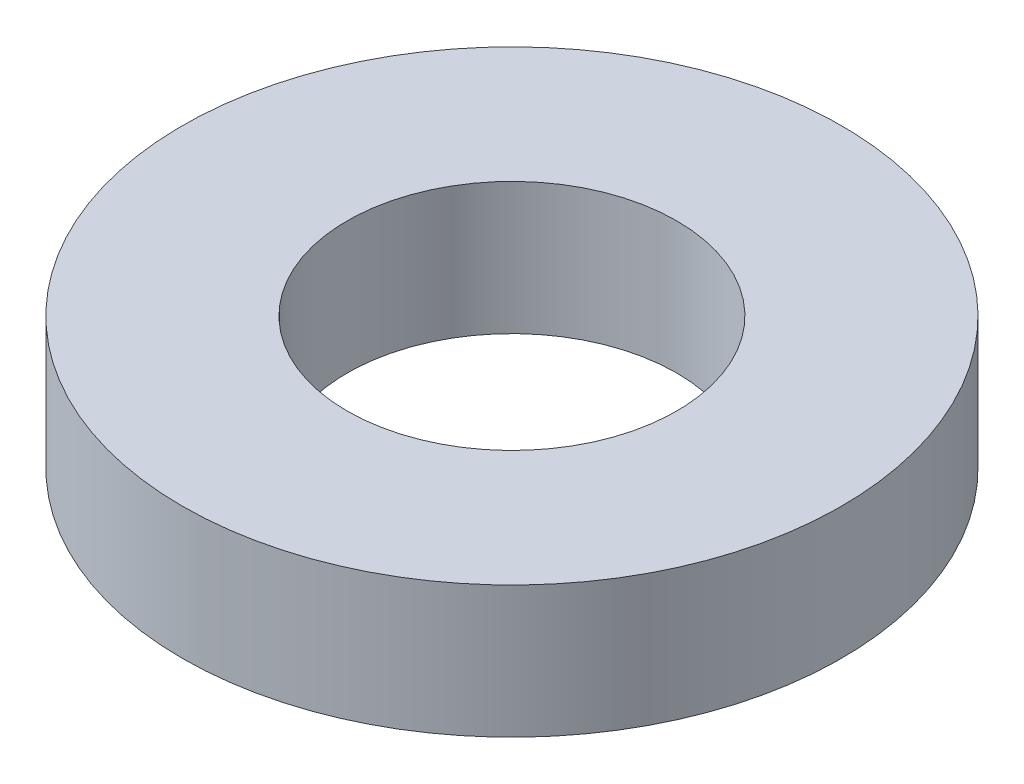
ISO-10303-21;
HEADER;
FILE_DESCRIPTION(('STEP AP214'),'2;1');
FILE_NAME('part.step','',(''),(''),'','','');
FILE_SCHEMA(('AUTOMOTIVE_DESIGN { 1 0 10303 214 1 1 1 1 }'));
ENDSEC;
DATA;
#1=APPLICATION_CONTEXT('core data for automotive mechanical design processes');
#2=APPLICATION_PROTOCOL_DEFINITION('international standard','automotive_design',2000,#1);
#3=PRODUCT_CONTEXT('',#1,'mechanical');
#4=PRODUCT('Part','Part','',(#3));
#5=PRODUCT_RELATED_PRODUCT_CATEGORY('part','',(#4));
#6=PRODUCT_DEFINITION_FORMATION('','',#4);
#7=PRODUCT_DEFINITION_CONTEXT('part definition',#1,'design');
#8=PRODUCT_DEFINITION('design','',#6,#7);
#9=PRODUCT_DEFINITION_SHAPE('','',#8);
#10=(LENGTH_UNIT() NAMED_UNIT(*) SI_UNIT(.MILLI.,.METRE.));
#11=(NAMED_UNIT(*) PLANE_ANGLE_UNIT() SI_UNIT($,.RADIAN.));
#12=(NAMED_UNIT(*) SI_UNIT($,.STERADIAN.) SOLID_ANGLE_UNIT());
#13=UNCERTAINTY_MEASURE_WITH_UNIT(LENGTH_MEASURE(1.E-05),#10,'distance_accuracy_value','');
#14=(GEOMETRIC_REPRESENTATION_CONTEXT(3) GLOBAL_UNCERTAINTY_ASSIGNED_CONTEXT((#13)) GLOBAL_UNIT_ASSIGNED_CONTEXT((#10,
#11,#12)) REPRESENTATION_CONTEXT('',''));
#15=CARTESIAN_POINT('',(0.,0.,0.));
#16=DIRECTION('',(0.,0.,1.));
#17=DIRECTION('',(1.,0.,0.));
#18=AXIS2_PLACEMENT_3D('',#15,#16,#17);
#19=CARTESIAN_POINT('',(0.,2.,0.));
#20=DIRECTION('',(0.,1.,0.));
#21=DIRECTION('',(0.,0.,1.));
#22=AXIS2_PLACEMENT_3D('',#19,#20,#21);
#23=PLANE('',#22);
#24=CARTESIAN_POINT('',(0.,2.,0.));
#25=DIRECTION('',(0.,1.,0.));
#26=DIRECTION('',(0.,0.,1.));
#27=AXIS2_PLACEMENT_3D('',#24,#25,#26);
#28=CIRCLE('',#27,5.);
#29=CARTESIAN_POINT('',(0.,2.,5.));
#30=VERTEX_POINT('',#29);
#31=EDGE_CURVE('E10',#30,#30,#28,.T.);
#32=ORIENTED_EDGE('',*,*,#31,.T.);
#33=EDGE_LOOP('',(#32));
#34=FACE_BOUND('',#33,.T.);
#35=CARTESIAN_POINT('',(0.,2.,0.));
#36=DIRECTION('',(0.,1.,0.));
#37=DIRECTION('',(0.,0.,1.));
#38=AXIS2_PLACEMENT_3D('',#35,#36,#37);
#39=CIRCLE('',#38,2.5);
#40=CARTESIAN_POINT('',(0.,2.,2.5));
#41=VERTEX_POINT('',#40);
#42=EDGE_CURVE('E54',#41,#41,#39,.T.);
#43=ORIENTED_EDGE('',*,*,#42,.F.);
#44=EDGE_LOOP('',(#43));
#45=FACE_BOUND('',#44,.T.);
#46=ADVANCED_FACE('F41',(#34,#45),#23,.T.);
#47=CARTESIAN_POINT('',(0.,0.,0.));
#48=DIRECTION('',(0.,1.,0.));
#49=DIRECTION('',(0.,0.,1.));
#50=AXIS2_PLACEMENT_3D('',#47,#48,#49);
#51=PLANE('',#50);
#52=CARTESIAN_POINT('',(0.,0.,0.));
#53=DIRECTION('',(0.,1.,0.));
#54=DIRECTION('',(0.,0.,1.));
#55=AXIS2_PLACEMENT_3D('',#52,#53,#54);
#56=CIRCLE('',#55,5.);
#57=CARTESIAN_POINT('',(0.,0.,5.));
#58=VERTEX_POINT('',#57);
#59=EDGE_CURVE('E45',#58,#58,#56,.T.);
#60=ORIENTED_EDGE('',*,*,#59,.F.);
#61=EDGE_LOOP('',(#60));
#62=FACE_BOUND('',#61,.T.);
#63=CARTESIAN_POINT('',(0.,0.,0.));
#64=DIRECTION('',(0.,1.,0.));
#65=DIRECTION('',(0.,0.,1.));
#66=AXIS2_PLACEMENT_3D('',#63,#64,#65);
#67=CIRCLE('',#66,2.5);
#68=CARTESIAN_POINT('',(0.,0.,2.5));
#69=VERTEX_POINT('',#68);
#70=EDGE_CURVE('E56',#69,#69,#67,.T.);
#71=ORIENTED_EDGE('',*,*,#70,.T.);
#72=EDGE_LOOP('',(#71));
#73=FACE_BOUND('',#72,.T.);
#74=ADVANCED_FACE('F68',(#62,#73),#51,.F.);
#75=CARTESIAN_POINT('',(0.,2.,0.));
#76=DIRECTION('',(0.,-1.,0.));
#77=DIRECTION('',(0.,0.,-1.));
#78=AXIS2_PLACEMENT_3D('',#75,#76,#77);
#79=CYLINDRICAL_SURFACE('',#78,5.);
#80=ORIENTED_EDGE('',*,*,#31,.F.);
#81=EDGE_LOOP('',(#80));
#82=FACE_BOUND('',#81,.T.);
#83=ORIENTED_EDGE('',*,*,#59,.T.);
#84=EDGE_LOOP('',(#83));
#85=FACE_BOUND('',#84,.T.);
#86=ADVANCED_FACE('F43',(#82,#85),#79,.T.);
#87=CARTESIAN_POINT('',(0.,2.,0.));
#88=DIRECTION('',(0.,-1.,0.));
#89=DIRECTION('',(0.,0.,-1.));
#90=AXIS2_PLACEMENT_3D('',#87,#88,#89);
#91=CYLINDRICAL_SURFACE('',#90,2.5);
#92=ORIENTED_EDGE('',*,*,#42,.T.);
#93=EDGE_LOOP('',(#92));
#94=FACE_BOUND('',#93,.T.);
#95=ORIENTED_EDGE('',*,*,#70,.F.);
#96=EDGE_LOOP('',(#95));
#97=FACE_BOUND('',#96,.T.);
#98=ADVANCED_FACE('F64',(#94,#97),#91,.F.);
#99=CLOSED_SHELL('',(#46,#74,#86,#98));
#100=MANIFOLD_SOLID_BREP('B2',#99);
#101=ADVANCED_BREP_SHAPE_REPRESENTATION('',(#18,#100),#14);
#102=SHAPE_DEFINITION_REPRESENTATION(#9,#101);
ENDSEC;
END-ISO-10303-21;
